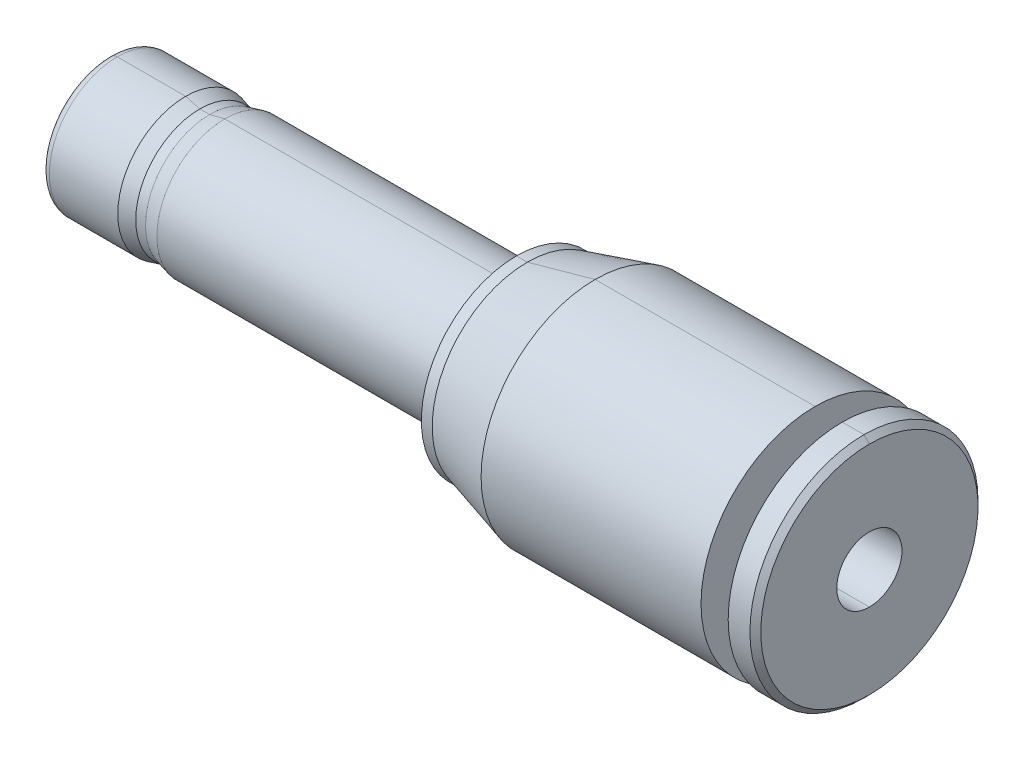
ISO-10303-21;
HEADER;
FILE_DESCRIPTION(('STEP AP214'),'2;1');
FILE_NAME('part.step','',(''),(''),'','','');
FILE_SCHEMA(('AUTOMOTIVE_DESIGN { 1 0 10303 214 1 1 1 1 }'));
ENDSEC;
DATA;
#1=APPLICATION_CONTEXT('core data for automotive mechanical design processes');
#2=APPLICATION_PROTOCOL_DEFINITION('international standard','automotive_design',2000,#1);
#3=PRODUCT_CONTEXT('',#1,'mechanical');
#4=PRODUCT('Part','Part','',(#3));
#5=PRODUCT_RELATED_PRODUCT_CATEGORY('part','',(#4));
#6=PRODUCT_DEFINITION_FORMATION('','',#4);
#7=PRODUCT_DEFINITION_CONTEXT('part definition',#1,'design');
#8=PRODUCT_DEFINITION('design','',#6,#7);
#9=PRODUCT_DEFINITION_SHAPE('','',#8);
#10=(LENGTH_UNIT() NAMED_UNIT(*) SI_UNIT(.MILLI.,.METRE.));
#11=(NAMED_UNIT(*) PLANE_ANGLE_UNIT() SI_UNIT($,.RADIAN.));
#12=(NAMED_UNIT(*) SI_UNIT($,.STERADIAN.) SOLID_ANGLE_UNIT());
#13=UNCERTAINTY_MEASURE_WITH_UNIT(LENGTH_MEASURE(1.E-05),#10,'distance_accuracy_value','');
#14=(GEOMETRIC_REPRESENTATION_CONTEXT(3) GLOBAL_UNCERTAINTY_ASSIGNED_CONTEXT((#13)) GLOBAL_UNIT_ASSIGNED_CONTEXT((#10,
#11,#12)) REPRESENTATION_CONTEXT('',''));
#15=CARTESIAN_POINT('',(0.,0.,0.));
#16=DIRECTION('',(0.,0.,1.));
#17=DIRECTION('',(1.,0.,0.));
#18=AXIS2_PLACEMENT_3D('',#15,#16,#17);
#19=CARTESIAN_POINT('',(-18.669,0.,0.));
#20=DIRECTION('',(1.,0.,0.));
#21=DIRECTION('',(0.,0.999631209293883,0.0271559460459095));
#22=AXIS2_PLACEMENT_3D('',#19,#20,#21);
#23=TOROIDAL_SURFACE('',#22,2.794,0.381);
#24=CARTESIAN_POINT('',(-18.669,-2.794,0.));
#25=DIRECTION('',(0.,0.,-1.));
#26=DIRECTION('',(0.,-1.,0.));
#27=AXIS2_PLACEMENT_3D('',#24,#25,#26);
#28=CIRCLE('',#27,0.381);
#29=CARTESIAN_POINT('',(-19.0499999999999,-2.7939993957467,0.));
#30=VERTEX_POINT('',#29);
#31=CARTESIAN_POINT('',(-18.669,-3.175,0.));
#32=VERTEX_POINT('',#31);
#33=EDGE_CURVE('E237',#30,#32,#28,.F.);
#34=ORIENTED_EDGE('',*,*,#33,.F.);
#35=CARTESIAN_POINT('',(-19.0499999999998,0.,0.));
#36=DIRECTION('',(1.,0.,0.));
#37=DIRECTION('',(0.,-1.,0.));
#38=AXIS2_PLACEMENT_3D('',#35,#36,#37);
#39=CIRCLE('',#38,2.7939995683905);
#40=CARTESIAN_POINT('',(-19.0499999999999,2.7939993957467,0.));
#41=VERTEX_POINT('',#40);
#42=EDGE_CURVE('E251',#30,#41,#39,.T.);
#43=ORIENTED_EDGE('',*,*,#42,.T.);
#44=CARTESIAN_POINT('',(-18.669,2.794,0.));
#45=DIRECTION('',(0.,0.,1.));
#46=DIRECTION('',(0.,1.,0.));
#47=AXIS2_PLACEMENT_3D('',#44,#45,#46);
#48=CIRCLE('',#47,0.381);
#49=CARTESIAN_POINT('',(-18.669,3.175,0.));
#50=VERTEX_POINT('',#49);
#51=EDGE_CURVE('E240',#50,#41,#48,.T.);
#52=ORIENTED_EDGE('',*,*,#51,.F.);
#53=CARTESIAN_POINT('',(-18.669,0.,0.));
#54=DIRECTION('',(1.,0.,0.));
#55=DIRECTION('',(0.,0.,-1.));
#56=AXIS2_PLACEMENT_3D('',#53,#54,#55);
#57=CIRCLE('',#56,3.175);
#58=EDGE_CURVE('E262',#32,#50,#57,.T.);
#59=ORIENTED_EDGE('',*,*,#58,.F.);
#60=EDGE_LOOP('',(#34,#43,#52,#59));
#61=FACE_BOUND('',#60,.T.);
#62=ADVANCED_FACE('F15',(#61),#23,.T.);
#63=CARTESIAN_POINT('',(-18.669,0.,0.));
#64=DIRECTION('',(1.,0.,0.));
#65=DIRECTION('',(0.,-0.999631209293883,-0.0271559460459095));
#66=AXIS2_PLACEMENT_3D('',#63,#64,#65);
#67=TOROIDAL_SURFACE('',#66,2.794,0.381);
#68=ORIENTED_EDGE('',*,*,#51,.T.);
#69=CARTESIAN_POINT('',(-19.0499999999998,0.,0.));
#70=DIRECTION('',(1.,0.,0.));
#71=DIRECTION('',(0.,1.,0.));
#72=AXIS2_PLACEMENT_3D('',#69,#70,#71);
#73=CIRCLE('',#72,2.7939995683905);
#74=EDGE_CURVE('E244',#41,#30,#73,.T.);
#75=ORIENTED_EDGE('',*,*,#74,.T.);
#76=ORIENTED_EDGE('',*,*,#33,.T.);
#77=CARTESIAN_POINT('',(-18.669,0.,0.));
#78=DIRECTION('',(1.,0.,0.));
#79=DIRECTION('',(0.,0.,-1.));
#80=AXIS2_PLACEMENT_3D('',#77,#78,#79);
#81=CIRCLE('',#80,3.175);
#82=EDGE_CURVE('E235',#50,#32,#81,.T.);
#83=ORIENTED_EDGE('',*,*,#82,.F.);
#84=EDGE_LOOP('',(#68,#75,#76,#83));
#85=FACE_BOUND('',#84,.T.);
#86=ADVANCED_FACE('F219',(#85),#67,.T.);
#87=CARTESIAN_POINT('',(-19.05,0.,0.));
#88=DIRECTION('',(1.,0.,0.));
#89=DIRECTION('',(0.,0.,-1.));
#90=AXIS2_PLACEMENT_3D('',#87,#88,#89);
#91=PLANE('',#90);
#92=CARTESIAN_POINT('',(-19.05,0.,0.));
#93=DIRECTION('',(-1.,0.,0.));
#94=DIRECTION('',(0.,0.,1.));
#95=AXIS2_PLACEMENT_3D('',#92,#93,#94);
#96=CIRCLE('',#95,1.524);
#97=CARTESIAN_POINT('',(-19.05,1.524,0.));
#98=VERTEX_POINT('',#97);
#99=CARTESIAN_POINT('',(-19.05,-1.524,0.));
#100=VERTEX_POINT('',#99);
#101=EDGE_CURVE('E139',#98,#100,#96,.F.);
#102=ORIENTED_EDGE('',*,*,#101,.T.);
#103=CARTESIAN_POINT('',(-19.05,0.,0.));
#104=DIRECTION('',(-1.,0.,0.));
#105=DIRECTION('',(0.,0.,1.));
#106=AXIS2_PLACEMENT_3D('',#103,#104,#105);
#107=CIRCLE('',#106,1.524);
#108=EDGE_CURVE('E20',#100,#98,#107,.F.);
#109=ORIENTED_EDGE('',*,*,#108,.T.);
#110=EDGE_LOOP('',(#102,#109));
#111=FACE_BOUND('',#110,.T.);
#112=ORIENTED_EDGE('',*,*,#74,.F.);
#113=ORIENTED_EDGE('',*,*,#42,.F.);
#114=EDGE_LOOP('',(#112,#113));
#115=FACE_BOUND('',#114,.T.);
#116=ADVANCED_FACE('F142',(#111,#115),#91,.F.);
#117=CARTESIAN_POINT('',(-20.828,0.,0.));
#118=DIRECTION('',(1.,0.,0.));
#119=DIRECTION('',(0.,0.,-1.));
#120=AXIS2_PLACEMENT_3D('',#117,#118,#119);
#121=CYLINDRICAL_SURFACE('',#120,3.175);
#122=DIRECTION('',(1.,0.,0.));
#123=VECTOR('',#122,1.);
#124=CARTESIAN_POINT('',(-20.828,3.175,0.));
#125=LINE('',#124,#123);
#126=CARTESIAN_POINT('',(-15.468599999906,3.1749999999849,0.));
#127=VERTEX_POINT('',#126);
#128=EDGE_CURVE('E282',#127,#50,#125,.F.);
#129=ORIENTED_EDGE('',*,*,#128,.F.);
#130=CARTESIAN_POINT('',(-15.4685999999629,0.,0.));
#131=DIRECTION('',(-1.,0.,0.));
#132=DIRECTION('',(0.,1.,0.));
#133=AXIS2_PLACEMENT_3D('',#130,#131,#132);
#134=CIRCLE('',#133,3.17499999999882);
#135=CARTESIAN_POINT('',(-15.468599999925,-3.1749999999849,0.));
#136=VERTEX_POINT('',#135);
#137=EDGE_CURVE('E158',#136,#127,#134,.F.);
#138=ORIENTED_EDGE('',*,*,#137,.F.);
#139=DIRECTION('',(1.,0.,0.));
#140=VECTOR('',#139,1.);
#141=CARTESIAN_POINT('',(-20.828,-3.175,0.));
#142=LINE('',#141,#140);
#143=EDGE_CURVE('E147',#32,#136,#142,.T.);
#144=ORIENTED_EDGE('',*,*,#143,.F.);
#145=ORIENTED_EDGE('',*,*,#58,.T.);
#146=EDGE_LOOP('',(#129,#138,#144,#145));
#147=FACE_BOUND('',#146,.T.);
#148=ADVANCED_FACE('F590',(#147),#121,.T.);
#149=CARTESIAN_POINT('',(-20.828,0.,0.));
#150=DIRECTION('',(1.,0.,0.));
#151=DIRECTION('',(0.,0.,-1.));
#152=AXIS2_PLACEMENT_3D('',#149,#150,#151);
#153=CYLINDRICAL_SURFACE('',#152,3.175);
#154=ORIENTED_EDGE('',*,*,#143,.T.);
#155=CARTESIAN_POINT('',(-15.4685999999629,0.,0.));
#156=DIRECTION('',(-1.,0.,0.));
#157=DIRECTION('',(0.,1.,0.));
#158=AXIS2_PLACEMENT_3D('',#155,#156,#157);
#159=CIRCLE('',#158,3.17499999999882);
#160=EDGE_CURVE('E163',#127,#136,#159,.F.);
#161=ORIENTED_EDGE('',*,*,#160,.F.);
#162=ORIENTED_EDGE('',*,*,#128,.T.);
#163=ORIENTED_EDGE('',*,*,#82,.T.);
#164=EDGE_LOOP('',(#154,#161,#162,#163));
#165=FACE_BOUND('',#164,.T.);
#166=ADVANCED_FACE('F583',(#165),#153,.T.);
#167=CARTESIAN_POINT('',(16.51,0.,0.));
#168=DIRECTION('',(-1.,0.,0.));
#169=DIRECTION('',(0.,0.,1.));
#170=AXIS2_PLACEMENT_3D('',#167,#168,#169);
#171=CYLINDRICAL_SURFACE('',#170,1.524);
#172=DIRECTION('',(-1.,0.,0.));
#173=VECTOR('',#172,1.);
#174=CARTESIAN_POINT('',(16.51,1.524,0.));
#175=LINE('',#174,#173);
#176=CARTESIAN_POINT('',(16.51,1.524,0.));
#177=VERTEX_POINT('',#176);
#178=EDGE_CURVE('E146',#177,#98,#175,.T.);
#179=ORIENTED_EDGE('',*,*,#178,.T.);
#180=ORIENTED_EDGE('',*,*,#108,.F.);
#181=DIRECTION('',(-1.,0.,0.));
#182=VECTOR('',#181,1.);
#183=CARTESIAN_POINT('',(16.51,-1.524,0.));
#184=LINE('',#183,#182);
#185=CARTESIAN_POINT('',(16.51,-1.524,0.));
#186=VERTEX_POINT('',#185);
#187=EDGE_CURVE('E157',#100,#186,#184,.F.);
#188=ORIENTED_EDGE('',*,*,#187,.T.);
#189=CARTESIAN_POINT('',(16.51,0.,0.));
#190=DIRECTION('',(-1.,0.,0.));
#191=DIRECTION('',(0.,0.,1.));
#192=AXIS2_PLACEMENT_3D('',#189,#190,#191);
#193=CIRCLE('',#192,1.524);
#194=EDGE_CURVE('E151',#177,#186,#193,.T.);
#195=ORIENTED_EDGE('',*,*,#194,.F.);
#196=EDGE_LOOP('',(#179,#180,#188,#195));
#197=FACE_BOUND('',#196,.T.);
#198=ADVANCED_FACE('F149',(#197),#171,.F.);
#199=CARTESIAN_POINT('',(16.51,0.,0.));
#200=DIRECTION('',(-1.,0.,0.));
#201=DIRECTION('',(0.,0.,1.));
#202=AXIS2_PLACEMENT_3D('',#199,#200,#201);
#203=CYLINDRICAL_SURFACE('',#202,1.524);
#204=ORIENTED_EDGE('',*,*,#187,.F.);
#205=ORIENTED_EDGE('',*,*,#101,.F.);
#206=ORIENTED_EDGE('',*,*,#178,.F.);
#207=CARTESIAN_POINT('',(16.51,0.,0.));
#208=DIRECTION('',(-1.,0.,0.));
#209=DIRECTION('',(0.,0.,1.));
#210=AXIS2_PLACEMENT_3D('',#207,#208,#209);
#211=CIRCLE('',#210,1.524);
#212=EDGE_CURVE('E162',#186,#177,#211,.T.);
#213=ORIENTED_EDGE('',*,*,#212,.F.);
#214=EDGE_LOOP('',(#204,#205,#206,#213));
#215=FACE_BOUND('',#214,.T.);
#216=ADVANCED_FACE('F156',(#215),#203,.F.);
#217=CARTESIAN_POINT('',(-15.4685999998492,0.,0.));
#218=DIRECTION('',(-1.,0.,0.));
#219=DIRECTION('',(0.,0.,1.));
#220=AXIS2_PLACEMENT_3D('',#217,#218,#219);
#221=CONICAL_SURFACE('',#220,3.17499999994197,0.261799387773816);
#222=DIRECTION('',(0.965925826289081,0.258819045102473,0.));
#223=VECTOR('',#222,1.);
#224=CARTESIAN_POINT('',(-499000.,-133705.677224226,-1.63742229640477E-11));
#225=LINE('',#224,#223);
#226=CARTESIAN_POINT('',(-14.8050413663964,-2.9971999999954,0.));
#227=VERTEX_POINT('',#226);
#228=EDGE_CURVE('E295',#136,#227,#225,.T.);
#229=ORIENTED_EDGE('',*,*,#228,.F.);
#230=ORIENTED_EDGE('',*,*,#137,.T.);
#231=DIRECTION('',(0.965925826289081,-0.258819045102473,0.));
#232=VECTOR('',#231,1.);
#233=CARTESIAN_POINT('',(-499000.,133705.677224226,0.));
#234=LINE('',#233,#232);
#235=CARTESIAN_POINT('',(-14.8050413663964,2.9971999999954,0.));
#236=VERTEX_POINT('',#235);
#237=EDGE_CURVE('E293',#236,#127,#234,.F.);
#238=ORIENTED_EDGE('',*,*,#237,.F.);
#239=CARTESIAN_POINT('',(-14.8050413664138,0.,0.));
#240=DIRECTION('',(-1.,0.,0.));
#241=DIRECTION('',(0.,0.,1.));
#242=AXIS2_PLACEMENT_3D('',#239,#240,#241);
#243=CIRCLE('',#242,2.9972);
#244=EDGE_CURVE('E165',#227,#236,#243,.F.);
#245=ORIENTED_EDGE('',*,*,#244,.F.);
#246=EDGE_LOOP('',(#229,#230,#238,#245));
#247=FACE_BOUND('',#246,.T.);
#248=ADVANCED_FACE('F562',(#247),#221,.T.);
#249=CARTESIAN_POINT('',(-15.4685999998492,0.,0.));
#250=DIRECTION('',(-1.,0.,0.));
#251=DIRECTION('',(0.,0.,1.));
#252=AXIS2_PLACEMENT_3D('',#249,#250,#251);
#253=CONICAL_SURFACE('',#252,3.17499999994197,0.261799387773816);
#254=ORIENTED_EDGE('',*,*,#237,.T.);
#255=ORIENTED_EDGE('',*,*,#160,.T.);
#256=ORIENTED_EDGE('',*,*,#228,.T.);
#257=CARTESIAN_POINT('',(-14.8050413664138,0.,0.));
#258=DIRECTION('',(-1.,0.,0.));
#259=DIRECTION('',(0.,0.,1.));
#260=AXIS2_PLACEMENT_3D('',#257,#258,#259);
#261=CIRCLE('',#260,2.9972);
#262=EDGE_CURVE('E301',#236,#227,#261,.F.);
#263=ORIENTED_EDGE('',*,*,#262,.F.);
#264=EDGE_LOOP('',(#254,#255,#256,#263));
#265=FACE_BOUND('',#264,.T.);
#266=ADVANCED_FACE('F554',(#265),#253,.T.);
#267=CARTESIAN_POINT('',(16.51,0.,0.));
#268=DIRECTION('',(1.,0.,0.));
#269=DIRECTION('',(0.,0.,-1.));
#270=AXIS2_PLACEMENT_3D('',#267,#268,#269);
#271=PLANE('',#270);
#272=ORIENTED_EDGE('',*,*,#194,.T.);
#273=ORIENTED_EDGE('',*,*,#212,.T.);
#274=EDGE_LOOP('',(#272,#273));
#275=FACE_BOUND('',#274,.T.);
#276=CARTESIAN_POINT('',(16.5099999999825,0.,0.));
#277=DIRECTION('',(-1.,0.,0.));
#278=DIRECTION('',(0.,0.,1.));
#279=AXIS2_PLACEMENT_3D('',#276,#277,#278);
#280=CIRCLE('',#279,5.08000000007769);
#281=CARTESIAN_POINT('',(16.5099999999825,-5.08000000007769,0.));
#282=VERTEX_POINT('',#281);
#283=CARTESIAN_POINT('',(16.5099999999825,5.08000000007769,0.));
#284=VERTEX_POINT('',#283);
#285=EDGE_CURVE('E166',#282,#284,#280,.T.);
#286=ORIENTED_EDGE('',*,*,#285,.F.);
#287=CARTESIAN_POINT('',(16.5099999999825,0.,0.));
#288=DIRECTION('',(-1.,0.,0.));
#289=DIRECTION('',(0.,0.,1.));
#290=AXIS2_PLACEMENT_3D('',#287,#288,#289);
#291=CIRCLE('',#290,5.08000000007769);
#292=EDGE_CURVE('E169',#284,#282,#291,.T.);
#293=ORIENTED_EDGE('',*,*,#292,.F.);
#294=EDGE_LOOP('',(#286,#293));
#295=FACE_BOUND('',#294,.T.);
#296=ADVANCED_FACE('F546',(#275,#295),#271,.T.);
#297=CARTESIAN_POINT('',(-13.54836,0.,0.));
#298=DIRECTION('',(-1.,0.,0.));
#299=DIRECTION('',(0.,0.,1.));
#300=AXIS2_PLACEMENT_3D('',#297,#298,#299);
#301=CYLINDRICAL_SURFACE('',#300,2.9972);
#302=ORIENTED_EDGE('',*,*,#244,.T.);
#303=DIRECTION('',(-1.,0.,0.));
#304=VECTOR('',#303,1.);
#305=CARTESIAN_POINT('',(-13.54836,2.9972,0.));
#306=LINE('',#305,#304);
#307=CARTESIAN_POINT('',(-14.347841366515,2.99719999999331,0.));
#308=VERTEX_POINT('',#307);
#309=EDGE_CURVE('E170',#308,#236,#306,.T.);
#310=ORIENTED_EDGE('',*,*,#309,.F.);
#311=CARTESIAN_POINT('',(-14.3478413664297,0.,0.));
#312=DIRECTION('',(1.,0.,0.));
#313=DIRECTION('',(0.,-1.,0.));
#314=AXIS2_PLACEMENT_3D('',#311,#312,#313);
#315=CIRCLE('',#314,2.99720000001003);
#316=CARTESIAN_POINT('',(-14.3478413664826,-2.99719999999331,0.));
#317=VERTEX_POINT('',#316);
#318=EDGE_CURVE('E316',#317,#308,#315,.T.);
#319=ORIENTED_EDGE('',*,*,#318,.F.);
#320=DIRECTION('',(-1.,0.,0.));
#321=VECTOR('',#320,1.);
#322=CARTESIAN_POINT('',(-13.54836,-2.9972,0.));
#323=LINE('',#322,#321);
#324=EDGE_CURVE('E304',#227,#317,#323,.F.);
#325=ORIENTED_EDGE('',*,*,#324,.F.);
#326=EDGE_LOOP('',(#302,#310,#319,#325));
#327=FACE_BOUND('',#326,.T.);
#328=ADVANCED_FACE('F538',(#327),#301,.T.);
#329=CARTESIAN_POINT('',(-13.54836,0.,0.));
#330=DIRECTION('',(-1.,0.,0.));
#331=DIRECTION('',(0.,0.,1.));
#332=AXIS2_PLACEMENT_3D('',#329,#330,#331);
#333=CYLINDRICAL_SURFACE('',#332,2.9972);
#334=CARTESIAN_POINT('',(-14.3478413664297,0.,0.));
#335=DIRECTION('',(1.,0.,0.));
#336=DIRECTION('',(0.,-1.,0.));
#337=AXIS2_PLACEMENT_3D('',#334,#335,#336);
#338=CIRCLE('',#337,2.99720000001003);
#339=EDGE_CURVE('E311',#308,#317,#338,.T.);
#340=ORIENTED_EDGE('',*,*,#339,.F.);
#341=ORIENTED_EDGE('',*,*,#309,.T.);
#342=ORIENTED_EDGE('',*,*,#262,.T.);
#343=ORIENTED_EDGE('',*,*,#324,.T.);
#344=EDGE_LOOP('',(#340,#341,#342,#343));
#345=FACE_BOUND('',#344,.T.);
#346=ADVANCED_FACE('F530',(#345),#333,.T.);
#347=CARTESIAN_POINT('',(16.2560000001122,0.,0.));
#348=DIRECTION('',(-1.,0.,0.));
#349=DIRECTION('',(0.,0.,1.));
#350=AXIS2_PLACEMENT_3D('',#347,#348,#349);
#351=CONICAL_SURFACE('',#350,5.33399999994799,0.785398163397448);
#352=ORIENTED_EDGE('',*,*,#285,.T.);
#353=DIRECTION('',(0.707106781186899,-0.707106781186196,0.));
#354=VECTOR('',#353,1.);
#355=CARTESIAN_POINT('',(-498978.410000496,499000.,0.));
#356=LINE('',#355,#354);
#357=CARTESIAN_POINT('',(16.256000000028,5.333999999987,0.));
#358=VERTEX_POINT('',#357);
#359=EDGE_CURVE('E319',#358,#284,#356,.T.);
#360=ORIENTED_EDGE('',*,*,#359,.F.);
#361=CARTESIAN_POINT('',(16.256,0.,0.));
#362=DIRECTION('',(1.,0.,0.));
#363=DIRECTION('',(0.,0.,-1.));
#364=AXIS2_PLACEMENT_3D('',#361,#362,#363);
#365=CIRCLE('',#364,5.334);
#366=CARTESIAN_POINT('',(16.256000000028,-5.333999999987,0.));
#367=VERTEX_POINT('',#366);
#368=EDGE_CURVE('E328',#367,#358,#365,.F.);
#369=ORIENTED_EDGE('',*,*,#368,.F.);
#370=DIRECTION('',(0.707106781186899,0.707106781186196,0.));
#371=VECTOR('',#370,1.);
#372=CARTESIAN_POINT('',(-498978.410000496,-499000.,-6.11098752774529E-11));
#373=LINE('',#372,#371);
#374=EDGE_CURVE('E173',#282,#367,#373,.F.);
#375=ORIENTED_EDGE('',*,*,#374,.F.);
#376=EDGE_LOOP('',(#352,#360,#369,#375));
#377=FACE_BOUND('',#376,.T.);
#378=ADVANCED_FACE('F522',(#377),#351,.T.);
#379=CARTESIAN_POINT('',(16.2560000001122,0.,0.));
#380=DIRECTION('',(-1.,0.,0.));
#381=DIRECTION('',(0.,0.,1.));
#382=AXIS2_PLACEMENT_3D('',#379,#380,#381);
#383=CONICAL_SURFACE('',#382,5.33399999994799,0.785398163397448);
#384=CARTESIAN_POINT('',(16.256,0.,0.));
#385=DIRECTION('',(1.,0.,0.));
#386=DIRECTION('',(0.,0.,-1.));
#387=AXIS2_PLACEMENT_3D('',#384,#385,#386);
#388=CIRCLE('',#387,5.334);
#389=EDGE_CURVE('E324',#358,#367,#388,.F.);
#390=ORIENTED_EDGE('',*,*,#389,.F.);
#391=ORIENTED_EDGE('',*,*,#359,.T.);
#392=ORIENTED_EDGE('',*,*,#292,.T.);
#393=ORIENTED_EDGE('',*,*,#374,.T.);
#394=EDGE_LOOP('',(#390,#391,#392,#393));
#395=FACE_BOUND('',#394,.T.);
#396=ADVANCED_FACE('F514',(#395),#383,.T.);
#397=CARTESIAN_POINT('',(-13.6398000001918,0.,0.));
#398=DIRECTION('',(1.,0.,0.));
#399=DIRECTION('',(0.,0.,-1.));
#400=AXIS2_PLACEMENT_3D('',#397,#398,#399);
#401=CONICAL_SURFACE('',#400,3.1749999999704,0.246028054716208);
#402=DIRECTION('',(-0.969887451177013,-0.24355355068107,0.));
#403=VECTOR('',#402,1.);
#404=CARTESIAN_POINT('',(499000.,125313.120668524,-1.53464312117874E-11));
#405=LINE('',#404,#403);
#406=CARTESIAN_POINT('',(-13.639800000048,3.1749999999926,0.));
#407=VERTEX_POINT('',#406);
#408=EDGE_CURVE('E315',#407,#308,#405,.T.);
#409=ORIENTED_EDGE('',*,*,#408,.F.);
#410=CARTESIAN_POINT('',(-13.6398,0.,0.));
#411=DIRECTION('',(1.,0.,0.));
#412=DIRECTION('',(0.,0.,-1.));
#413=AXIS2_PLACEMENT_3D('',#410,#411,#412);
#414=CIRCLE('',#413,3.175);
#415=CARTESIAN_POINT('',(-13.639800000048,-3.1749999999926,0.));
#416=VERTEX_POINT('',#415);
#417=EDGE_CURVE('E338',#416,#407,#414,.T.);
#418=ORIENTED_EDGE('',*,*,#417,.F.);
#419=DIRECTION('',(-0.969887451177013,0.24355355068107,0.));
#420=VECTOR('',#419,1.);
#421=CARTESIAN_POINT('',(499000.,-125313.120668524,0.));
#422=LINE('',#421,#420);
#423=EDGE_CURVE('E314',#317,#416,#422,.F.);
#424=ORIENTED_EDGE('',*,*,#423,.F.);
#425=ORIENTED_EDGE('',*,*,#318,.T.);
#426=EDGE_LOOP('',(#409,#418,#424,#425));
#427=FACE_BOUND('',#426,.T.);
#428=ADVANCED_FACE('F506',(#427),#401,.T.);
#429=CARTESIAN_POINT('',(-13.6398000001918,0.,0.));
#430=DIRECTION('',(1.,0.,0.));
#431=DIRECTION('',(0.,0.,-1.));
#432=AXIS2_PLACEMENT_3D('',#429,#430,#431);
#433=CONICAL_SURFACE('',#432,3.1749999999704,0.246028054716208);
#434=ORIENTED_EDGE('',*,*,#423,.T.);
#435=CARTESIAN_POINT('',(-13.6398,0.,0.));
#436=DIRECTION('',(1.,0.,0.));
#437=DIRECTION('',(0.,0.,-1.));
#438=AXIS2_PLACEMENT_3D('',#435,#436,#437);
#439=CIRCLE('',#438,3.175);
#440=EDGE_CURVE('E177',#407,#416,#439,.T.);
#441=ORIENTED_EDGE('',*,*,#440,.F.);
#442=ORIENTED_EDGE('',*,*,#408,.T.);
#443=ORIENTED_EDGE('',*,*,#339,.T.);
#444=EDGE_LOOP('',(#434,#441,#442,#443));
#445=FACE_BOUND('',#444,.T.);
#446=ADVANCED_FACE('F498',(#445),#433,.T.);
#447=CARTESIAN_POINT('',(-20.828,0.,0.));
#448=DIRECTION('',(1.,0.,0.));
#449=DIRECTION('',(0.,0.,-1.));
#450=AXIS2_PLACEMENT_3D('',#447,#448,#449);
#451=CYLINDRICAL_SURFACE('',#450,5.334);
#452=ORIENTED_EDGE('',*,*,#368,.T.);
#453=DIRECTION('',(1.,0.,0.));
#454=VECTOR('',#453,1.);
#455=CARTESIAN_POINT('',(-20.828,5.334,0.));
#456=LINE('',#455,#454);
#457=CARTESIAN_POINT('',(15.24,5.334,0.));
#458=VERTEX_POINT('',#457);
#459=EDGE_CURVE('E342',#458,#358,#456,.T.);
#460=ORIENTED_EDGE('',*,*,#459,.F.);
#461=CARTESIAN_POINT('',(15.24,0.,0.));
#462=DIRECTION('',(1.,0.,0.));
#463=DIRECTION('',(0.,0.,-1.));
#464=AXIS2_PLACEMENT_3D('',#461,#462,#463);
#465=CIRCLE('',#464,5.334);
#466=CARTESIAN_POINT('',(15.24,-5.334,0.));
#467=VERTEX_POINT('',#466);
#468=EDGE_CURVE('E174',#458,#467,#465,.T.);
#469=ORIENTED_EDGE('',*,*,#468,.T.);
#470=DIRECTION('',(1.,0.,0.));
#471=VECTOR('',#470,1.);
#472=CARTESIAN_POINT('',(-20.828,-5.334,0.));
#473=LINE('',#472,#471);
#474=EDGE_CURVE('E327',#367,#467,#473,.F.);
#475=ORIENTED_EDGE('',*,*,#474,.F.);
#476=EDGE_LOOP('',(#452,#460,#469,#475));
#477=FACE_BOUND('',#476,.T.);
#478=ADVANCED_FACE('F490',(#477),#451,.T.);
#479=CARTESIAN_POINT('',(-20.828,0.,0.));
#480=DIRECTION('',(1.,0.,0.));
#481=DIRECTION('',(0.,0.,-1.));
#482=AXIS2_PLACEMENT_3D('',#479,#480,#481);
#483=CYLINDRICAL_SURFACE('',#482,5.334);
#484=CARTESIAN_POINT('',(15.24,0.,0.));
#485=DIRECTION('',(1.,0.,0.));
#486=DIRECTION('',(0.,0.,-1.));
#487=AXIS2_PLACEMENT_3D('',#484,#485,#486);
#488=CIRCLE('',#487,5.334);
#489=EDGE_CURVE('E176',#467,#458,#488,.T.);
#490=ORIENTED_EDGE('',*,*,#489,.T.);
#491=ORIENTED_EDGE('',*,*,#459,.T.);
#492=ORIENTED_EDGE('',*,*,#389,.T.);
#493=ORIENTED_EDGE('',*,*,#474,.T.);
#494=EDGE_LOOP('',(#490,#491,#492,#493));
#495=FACE_BOUND('',#494,.T.);
#496=ADVANCED_FACE('F482',(#495),#483,.T.);
#497=CARTESIAN_POINT('',(-20.828,0.,0.));
#498=DIRECTION('',(1.,0.,0.));
#499=DIRECTION('',(0.,0.,-1.));
#500=AXIS2_PLACEMENT_3D('',#497,#498,#499);
#501=CYLINDRICAL_SURFACE('',#500,3.175);
#502=DIRECTION('',(1.,0.,0.));
#503=VECTOR('',#502,1.);
#504=CARTESIAN_POINT('',(-20.828,-3.175,0.));
#505=LINE('',#504,#503);
#506=CARTESIAN_POINT('',(0.,-3.175,0.));
#507=VERTEX_POINT('',#506);
#508=EDGE_CURVE('E341',#416,#507,#505,.T.);
#509=ORIENTED_EDGE('',*,*,#508,.F.);
#510=ORIENTED_EDGE('',*,*,#417,.T.);
#511=DIRECTION('',(1.,0.,0.));
#512=VECTOR('',#511,1.);
#513=CARTESIAN_POINT('',(-20.828,3.175,0.));
#514=LINE('',#513,#512);
#515=CARTESIAN_POINT('',(0.,3.175,0.));
#516=VERTEX_POINT('',#515);
#517=EDGE_CURVE('E337',#516,#407,#514,.F.);
#518=ORIENTED_EDGE('',*,*,#517,.F.);
#519=CARTESIAN_POINT('',(0.,0.,0.));
#520=DIRECTION('',(1.,0.,0.));
#521=DIRECTION('',(0.,0.,-1.));
#522=AXIS2_PLACEMENT_3D('',#519,#520,#521);
#523=CIRCLE('',#522,3.175);
#524=EDGE_CURVE('E180',#516,#507,#523,.F.);
#525=ORIENTED_EDGE('',*,*,#524,.T.);
#526=EDGE_LOOP('',(#509,#510,#518,#525));
#527=FACE_BOUND('',#526,.T.);
#528=ADVANCED_FACE('F474',(#527),#501,.T.);
#529=CARTESIAN_POINT('',(-20.828,0.,0.));
#530=DIRECTION('',(1.,0.,0.));
#531=DIRECTION('',(0.,0.,-1.));
#532=AXIS2_PLACEMENT_3D('',#529,#530,#531);
#533=CYLINDRICAL_SURFACE('',#532,3.175);
#534=ORIENTED_EDGE('',*,*,#517,.T.);
#535=ORIENTED_EDGE('',*,*,#440,.T.);
#536=ORIENTED_EDGE('',*,*,#508,.T.);
#537=CARTESIAN_POINT('',(0.,0.,0.));
#538=DIRECTION('',(1.,0.,0.));
#539=DIRECTION('',(0.,0.,-1.));
#540=AXIS2_PLACEMENT_3D('',#537,#538,#539);
#541=CIRCLE('',#540,3.175);
#542=EDGE_CURVE('E182',#507,#516,#541,.F.);
#543=ORIENTED_EDGE('',*,*,#542,.T.);
#544=EDGE_LOOP('',(#534,#535,#536,#543));
#545=FACE_BOUND('',#544,.T.);
#546=ADVANCED_FACE('F466',(#545),#533,.T.);
#547=CARTESIAN_POINT('',(15.24,0.,0.));
#548=DIRECTION('',(1.,0.,0.));
#549=DIRECTION('',(0.,0.,-1.));
#550=AXIS2_PLACEMENT_3D('',#547,#548,#549);
#551=PLANE('',#550);
#552=CARTESIAN_POINT('',(15.24,0.,0.));
#553=DIRECTION('',(1.,0.,0.));
#554=DIRECTION('',(0.,0.,-1.));
#555=AXIS2_PLACEMENT_3D('',#552,#553,#554);
#556=CIRCLE('',#555,3.175);
#557=CARTESIAN_POINT('',(15.24,3.175,0.));
#558=VERTEX_POINT('',#557);
#559=CARTESIAN_POINT('',(15.24,-3.175,0.));
#560=VERTEX_POINT('',#559);
#561=EDGE_CURVE('E187',#558,#560,#556,.F.);
#562=ORIENTED_EDGE('',*,*,#561,.F.);
#563=CARTESIAN_POINT('',(15.24,0.,0.));
#564=DIRECTION('',(1.,0.,0.));
#565=DIRECTION('',(0.,0.,-1.));
#566=AXIS2_PLACEMENT_3D('',#563,#564,#565);
#567=CIRCLE('',#566,3.175);
#568=EDGE_CURVE('E190',#560,#558,#567,.F.);
#569=ORIENTED_EDGE('',*,*,#568,.F.);
#570=EDGE_LOOP('',(#562,#569));
#571=FACE_BOUND('',#570,.T.);
#572=ORIENTED_EDGE('',*,*,#468,.F.);
#573=ORIENTED_EDGE('',*,*,#489,.F.);
#574=EDGE_LOOP('',(#572,#573));
#575=FACE_BOUND('',#574,.T.);
#576=ADVANCED_FACE('F458',(#571,#575),#551,.F.);
#577=CARTESIAN_POINT('',(0.,0.,0.));
#578=DIRECTION('',(1.,0.,0.));
#579=DIRECTION('',(0.,0.,-1.));
#580=AXIS2_PLACEMENT_3D('',#577,#578,#579);
#581=PLANE('',#580);
#582=ORIENTED_EDGE('',*,*,#524,.F.);
#583=ORIENTED_EDGE('',*,*,#542,.F.);
#584=EDGE_LOOP('',(#582,#583));
#585=FACE_BOUND('',#584,.T.);
#586=CARTESIAN_POINT('',(0.,0.,0.));
#587=DIRECTION('',(1.,0.,0.));
#588=DIRECTION('',(0.,0.,-1.));
#589=AXIS2_PLACEMENT_3D('',#586,#587,#588);
#590=CIRCLE('',#589,4.445);
#591=CARTESIAN_POINT('',(0.,4.445,0.));
#592=VERTEX_POINT('',#591);
#593=CARTESIAN_POINT('',(0.,-4.445,0.));
#594=VERTEX_POINT('',#593);
#595=EDGE_CURVE('E185',#592,#594,#590,.T.);
#596=ORIENTED_EDGE('',*,*,#595,.F.);
#597=CARTESIAN_POINT('',(0.,0.,0.));
#598=DIRECTION('',(1.,0.,0.));
#599=DIRECTION('',(0.,0.,-1.));
#600=AXIS2_PLACEMENT_3D('',#597,#598,#599);
#601=CIRCLE('',#600,4.445);
#602=EDGE_CURVE('E194',#594,#592,#601,.T.);
#603=ORIENTED_EDGE('',*,*,#602,.F.);
#604=EDGE_LOOP('',(#596,#603));
#605=FACE_BOUND('',#604,.T.);
#606=ADVANCED_FACE('F450',(#585,#605),#581,.F.);
#607=CARTESIAN_POINT('',(-20.828,0.,0.));
#608=DIRECTION('',(1.,0.,0.));
#609=DIRECTION('',(0.,0.,-1.));
#610=AXIS2_PLACEMENT_3D('',#607,#608,#609);
#611=CYLINDRICAL_SURFACE('',#610,4.445);
#612=CARTESIAN_POINT('',(0.507999999967979,0.,0.));
#613=DIRECTION('',(1.,0.,0.));
#614=DIRECTION('',(0.,-1.,0.));
#615=AXIS2_PLACEMENT_3D('',#612,#613,#614);
#616=CIRCLE('',#615,4.44499999997561);
#617=CARTESIAN_POINT('',(0.507999999991996,4.4449999999939,0.));
#618=VERTEX_POINT('',#617);
#619=CARTESIAN_POINT('',(0.507999999987994,-4.445,0.));
#620=VERTEX_POINT('',#619);
#621=EDGE_CURVE('E203',#618,#620,#616,.T.);
#622=ORIENTED_EDGE('',*,*,#621,.F.);
#623=DIRECTION('',(1.,0.,0.));
#624=VECTOR('',#623,1.);
#625=CARTESIAN_POINT('',(-20.828,4.445,0.));
#626=LINE('',#625,#624);
#627=EDGE_CURVE('E197',#592,#618,#626,.T.);
#628=ORIENTED_EDGE('',*,*,#627,.F.);
#629=ORIENTED_EDGE('',*,*,#595,.T.);
#630=DIRECTION('',(1.,0.,0.));
#631=VECTOR('',#630,1.);
#632=CARTESIAN_POINT('',(-20.828,-4.445,0.));
#633=LINE('',#632,#631);
#634=EDGE_CURVE('E198',#620,#594,#633,.F.);
#635=ORIENTED_EDGE('',*,*,#634,.F.);
#636=EDGE_LOOP('',(#622,#628,#629,#635));
#637=FACE_BOUND('',#636,.T.);
#638=ADVANCED_FACE('F442',(#637),#611,.T.);
#639=CARTESIAN_POINT('',(-20.828,0.,0.));
#640=DIRECTION('',(1.,0.,0.));
#641=DIRECTION('',(0.,0.,-1.));
#642=AXIS2_PLACEMENT_3D('',#639,#640,#641);
#643=CYLINDRICAL_SURFACE('',#642,3.175);
#644=CARTESIAN_POINT('',(13.97,0.,0.));
#645=DIRECTION('',(1.,0.,0.));
#646=DIRECTION('',(0.,0.,-1.));
#647=AXIS2_PLACEMENT_3D('',#644,#645,#646);
#648=CIRCLE('',#647,3.175);
#649=CARTESIAN_POINT('',(13.97,3.175,0.));
#650=VERTEX_POINT('',#649);
#651=CARTESIAN_POINT('',(13.97,-3.175,0.));
#652=VERTEX_POINT('',#651);
#653=EDGE_CURVE('E199',#650,#652,#648,.F.);
#654=ORIENTED_EDGE('',*,*,#653,.F.);
#655=DIRECTION('',(1.,0.,0.));
#656=VECTOR('',#655,1.);
#657=CARTESIAN_POINT('',(-20.828,3.175,0.));
#658=LINE('',#657,#656);
#659=EDGE_CURVE('E193',#558,#650,#658,.F.);
#660=ORIENTED_EDGE('',*,*,#659,.F.);
#661=ORIENTED_EDGE('',*,*,#561,.T.);
#662=DIRECTION('',(1.,0.,0.));
#663=VECTOR('',#662,1.);
#664=CARTESIAN_POINT('',(-20.828,-3.175,0.));
#665=LINE('',#664,#663);
#666=EDGE_CURVE('E189',#652,#560,#665,.T.);
#667=ORIENTED_EDGE('',*,*,#666,.F.);
#668=EDGE_LOOP('',(#654,#660,#661,#667));
#669=FACE_BOUND('',#668,.T.);
#670=ADVANCED_FACE('F434',(#669),#643,.T.);
#671=CARTESIAN_POINT('',(-20.828,0.,0.));
#672=DIRECTION('',(1.,0.,0.));
#673=DIRECTION('',(0.,0.,-1.));
#674=AXIS2_PLACEMENT_3D('',#671,#672,#673);
#675=CYLINDRICAL_SURFACE('',#674,3.175);
#676=ORIENTED_EDGE('',*,*,#568,.T.);
#677=ORIENTED_EDGE('',*,*,#659,.T.);
#678=CARTESIAN_POINT('',(13.97,0.,0.));
#679=DIRECTION('',(1.,0.,0.));
#680=DIRECTION('',(0.,0.,-1.));
#681=AXIS2_PLACEMENT_3D('',#678,#679,#680);
#682=CIRCLE('',#681,3.175);
#683=EDGE_CURVE('E202',#652,#650,#682,.F.);
#684=ORIENTED_EDGE('',*,*,#683,.F.);
#685=ORIENTED_EDGE('',*,*,#666,.T.);
#686=EDGE_LOOP('',(#676,#677,#684,#685));
#687=FACE_BOUND('',#686,.T.);
#688=ADVANCED_FACE('F426',(#687),#675,.T.);
#689=CARTESIAN_POINT('',(-20.828,0.,0.));
#690=DIRECTION('',(1.,0.,0.));
#691=DIRECTION('',(0.,0.,-1.));
#692=AXIS2_PLACEMENT_3D('',#689,#690,#691);
#693=CYLINDRICAL_SURFACE('',#692,4.445);
#694=ORIENTED_EDGE('',*,*,#602,.T.);
#695=ORIENTED_EDGE('',*,*,#627,.T.);
#696=CARTESIAN_POINT('',(0.507999999967979,0.,0.));
#697=DIRECTION('',(1.,0.,0.));
#698=DIRECTION('',(0.,-1.,0.));
#699=AXIS2_PLACEMENT_3D('',#696,#697,#698);
#700=CIRCLE('',#699,4.44499999997561);
#701=EDGE_CURVE('E353',#620,#618,#700,.T.);
#702=ORIENTED_EDGE('',*,*,#701,.F.);
#703=ORIENTED_EDGE('',*,*,#634,.T.);
#704=EDGE_LOOP('',(#694,#695,#702,#703));
#705=FACE_BOUND('',#704,.T.);
#706=ADVANCED_FACE('F394',(#705),#693,.T.);
#707=CARTESIAN_POINT('',(3.68300000002364,0.,0.));
#708=DIRECTION('',(1.,0.,0.));
#709=DIRECTION('',(0.,0.,-1.));
#710=AXIS2_PLACEMENT_3D('',#707,#708,#709);
#711=CONICAL_SURFACE('',#710,5.33399999997641,0.273008703082394);
#712=CARTESIAN_POINT('',(3.683,0.,0.));
#713=DIRECTION('',(1.,0.,0.));
#714=DIRECTION('',(0.,0.,-1.));
#715=AXIS2_PLACEMENT_3D('',#712,#713,#714);
#716=CIRCLE('',#715,5.334);
#717=CARTESIAN_POINT('',(3.68300000001773,5.33399999998231,0.));
#718=VERTEX_POINT('',#717);
#719=CARTESIAN_POINT('',(3.68300000001477,-5.33399999998526,0.));
#720=VERTEX_POINT('',#719);
#721=EDGE_CURVE('E35',#718,#720,#716,.T.);
#722=ORIENTED_EDGE('',*,*,#721,.F.);
#723=DIRECTION('',(-0.96296401971419,-0.269629925519943,0.));
#724=VECTOR('',#723,1.);
#725=CARTESIAN_POINT('',(499000.,139724.302759984,-1.7111292013811E-11));
#726=LINE('',#725,#724);
#727=EDGE_CURVE('E356',#618,#718,#726,.F.);
#728=ORIENTED_EDGE('',*,*,#727,.F.);
#729=ORIENTED_EDGE('',*,*,#621,.T.);
#730=DIRECTION('',(-0.96296401971419,0.269629925519943,0.));
#731=VECTOR('',#730,1.);
#732=CARTESIAN_POINT('',(499000.,-139724.302759984,0.));
#733=LINE('',#732,#731);
#734=EDGE_CURVE('E206',#720,#620,#733,.T.);
#735=ORIENTED_EDGE('',*,*,#734,.F.);
#736=EDGE_LOOP('',(#722,#728,#729,#735));
#737=FACE_BOUND('',#736,.T.);
#738=ADVANCED_FACE('F385',(#737),#711,.T.);
#739=CARTESIAN_POINT('',(13.97,0.,0.));
#740=DIRECTION('',(1.,0.,0.));
#741=DIRECTION('',(0.,0.,-1.));
#742=AXIS2_PLACEMENT_3D('',#739,#740,#741);
#743=PLANE('',#742);
#744=ORIENTED_EDGE('',*,*,#653,.T.);
#745=ORIENTED_EDGE('',*,*,#683,.T.);
#746=EDGE_LOOP('',(#744,#745));
#747=FACE_BOUND('',#746,.T.);
#748=CARTESIAN_POINT('',(13.97,0.,0.));
#749=DIRECTION('',(1.,0.,0.));
#750=DIRECTION('',(0.,0.,-1.));
#751=AXIS2_PLACEMENT_3D('',#748,#749,#750);
#752=CIRCLE('',#751,5.334);
#753=CARTESIAN_POINT('',(13.97,-5.334,0.));
#754=VERTEX_POINT('',#753);
#755=CARTESIAN_POINT('',(13.97,5.334,0.));
#756=VERTEX_POINT('',#755);
#757=EDGE_CURVE('E207',#754,#756,#752,.F.);
#758=ORIENTED_EDGE('',*,*,#757,.F.);
#759=CARTESIAN_POINT('',(13.97,0.,0.));
#760=DIRECTION('',(1.,0.,0.));
#761=DIRECTION('',(0.,0.,-1.));
#762=AXIS2_PLACEMENT_3D('',#759,#760,#761);
#763=CIRCLE('',#762,5.334);
#764=EDGE_CURVE('E210',#756,#754,#763,.F.);
#765=ORIENTED_EDGE('',*,*,#764,.F.);
#766=EDGE_LOOP('',(#758,#765));
#767=FACE_BOUND('',#766,.T.);
#768=ADVANCED_FACE('F383',(#747,#767),#743,.T.);
#769=CARTESIAN_POINT('',(3.68300000002364,0.,0.));
#770=DIRECTION('',(1.,0.,0.));
#771=DIRECTION('',(0.,0.,-1.));
#772=AXIS2_PLACEMENT_3D('',#769,#770,#771);
#773=CONICAL_SURFACE('',#772,5.33399999997641,0.273008703082394);
#774=ORIENTED_EDGE('',*,*,#701,.T.);
#775=ORIENTED_EDGE('',*,*,#727,.T.);
#776=CARTESIAN_POINT('',(3.683,0.,0.));
#777=DIRECTION('',(1.,0.,0.));
#778=DIRECTION('',(0.,0.,-1.));
#779=AXIS2_PLACEMENT_3D('',#776,#777,#778);
#780=CIRCLE('',#779,5.334);
#781=EDGE_CURVE('E26',#720,#718,#780,.T.);
#782=ORIENTED_EDGE('',*,*,#781,.F.);
#783=ORIENTED_EDGE('',*,*,#734,.T.);
#784=EDGE_LOOP('',(#774,#775,#782,#783));
#785=FACE_BOUND('',#784,.T.);
#786=ADVANCED_FACE('F378',(#785),#773,.T.);
#787=CARTESIAN_POINT('',(-20.828,0.,0.));
#788=DIRECTION('',(1.,0.,0.));
#789=DIRECTION('',(0.,0.,-1.));
#790=AXIS2_PLACEMENT_3D('',#787,#788,#789);
#791=CYLINDRICAL_SURFACE('',#790,5.334);
#792=ORIENTED_EDGE('',*,*,#757,.T.);
#793=DIRECTION('',(1.,0.,0.));
#794=VECTOR('',#793,1.);
#795=CARTESIAN_POINT('',(-20.828,5.334,0.));
#796=LINE('',#795,#794);
#797=EDGE_CURVE('E10',#718,#756,#796,.T.);
#798=ORIENTED_EDGE('',*,*,#797,.F.);
#799=ORIENTED_EDGE('',*,*,#721,.T.);
#800=DIRECTION('',(1.,0.,0.));
#801=VECTOR('',#800,1.);
#802=CARTESIAN_POINT('',(-20.828,-5.334,0.));
#803=LINE('',#802,#801);
#804=EDGE_CURVE('E213',#754,#720,#803,.F.);
#805=ORIENTED_EDGE('',*,*,#804,.F.);
#806=EDGE_LOOP('',(#792,#798,#799,#805));
#807=FACE_BOUND('',#806,.T.);
#808=ADVANCED_FACE('F381',(#807),#791,.T.);
#809=CARTESIAN_POINT('',(-20.828,0.,0.));
#810=DIRECTION('',(1.,0.,0.));
#811=DIRECTION('',(0.,0.,-1.));
#812=AXIS2_PLACEMENT_3D('',#809,#810,#811);
#813=CYLINDRICAL_SURFACE('',#812,5.334);
#814=ORIENTED_EDGE('',*,*,#781,.T.);
#815=ORIENTED_EDGE('',*,*,#797,.T.);
#816=ORIENTED_EDGE('',*,*,#764,.T.);
#817=ORIENTED_EDGE('',*,*,#804,.T.);
#818=EDGE_LOOP('',(#814,#815,#816,#817));
#819=FACE_BOUND('',#818,.T.);
#820=ADVANCED_FACE('F374',(#819),#813,.T.);
#821=CLOSED_SHELL('',(#62,#86,#116,#148,#166,#198,#216,#248,#266,#296,#328,#346,#378,#396,#428,
#446,#478,#496,#528,#546,#576,#606,#638,#670,#688,#706,#738,#768,#786,#808,#820));
#822=MANIFOLD_SOLID_BREP('B1',#821);
#823=ADVANCED_BREP_SHAPE_REPRESENTATION('',(#18,#822),#14);
#824=SHAPE_DEFINITION_REPRESENTATION(#9,#823);
ENDSEC;
END-ISO-10303-21;
